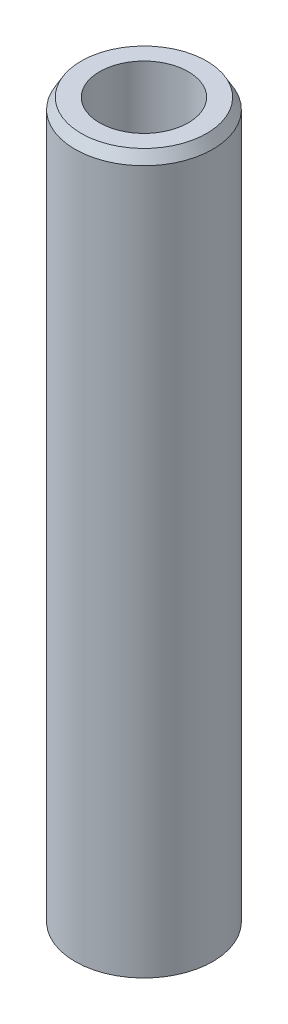
ISO-10303-21;
HEADER;
FILE_DESCRIPTION(('STEP AP214'),'2;1');
FILE_NAME('part.step','',(''),(''),'','','');
FILE_SCHEMA(('AUTOMOTIVE_DESIGN { 1 0 10303 214 1 1 1 1 }'));
ENDSEC;
DATA;
#1=APPLICATION_CONTEXT('core data for automotive mechanical design processes');
#2=APPLICATION_PROTOCOL_DEFINITION('international standard','automotive_design',2000,#1);
#3=PRODUCT_CONTEXT('',#1,'mechanical');
#4=PRODUCT('Part','Part','',(#3));
#5=PRODUCT_RELATED_PRODUCT_CATEGORY('part','',(#4));
#6=PRODUCT_DEFINITION_FORMATION('','',#4);
#7=PRODUCT_DEFINITION_CONTEXT('part definition',#1,'design');
#8=PRODUCT_DEFINITION('design','',#6,#7);
#9=PRODUCT_DEFINITION_SHAPE('','',#8);
#10=(LENGTH_UNIT() NAMED_UNIT(*) SI_UNIT(.MILLI.,.METRE.));
#11=(NAMED_UNIT(*) PLANE_ANGLE_UNIT() SI_UNIT($,.RADIAN.));
#12=(NAMED_UNIT(*) SI_UNIT($,.STERADIAN.) SOLID_ANGLE_UNIT());
#13=UNCERTAINTY_MEASURE_WITH_UNIT(LENGTH_MEASURE(1.E-05),#10,'distance_accuracy_value','');
#14=(GEOMETRIC_REPRESENTATION_CONTEXT(3) GLOBAL_UNCERTAINTY_ASSIGNED_CONTEXT((#13)) GLOBAL_UNIT_ASSIGNED_CONTEXT((#10,
#11,#12)) REPRESENTATION_CONTEXT('',''));
#15=CARTESIAN_POINT('',(0.,0.,0.));
#16=DIRECTION('',(0.,0.,1.));
#17=DIRECTION('',(1.,0.,0.));
#18=AXIS2_PLACEMENT_3D('',#15,#16,#17);
#19=CARTESIAN_POINT('',(0.,392.03608823877,0.));
#20=DIRECTION('',(0.,-1.,0.));
#21=DIRECTION('',(0.,0.,-1.));
#22=AXIS2_PLACEMENT_3D('',#19,#20,#21);
#23=CYLINDRICAL_SURFACE('',#22,37.5);
#24=CARTESIAN_POINT('',(0.,386.237186766016,0.));
#25=DIRECTION('',(0.,1.,0.));
#26=DIRECTION('',(0.,0.,1.));
#27=AXIS2_PLACEMENT_3D('',#24,#25,#26);
#28=CIRCLE('',#27,37.5);
#29=CARTESIAN_POINT('',(0.,386.237186766016,37.5));
#30=VERTEX_POINT('',#29);
#31=EDGE_CURVE('E50',#30,#30,#28,.F.);
#32=ORIENTED_EDGE('',*,*,#31,.T.);
#33=EDGE_LOOP('',(#32));
#34=FACE_BOUND('',#33,.T.);
#35=CARTESIAN_POINT('',(0.,3.3479973262987,0.));
#36=DIRECTION('',(0.,1.,0.));
#37=DIRECTION('',(0.,0.,1.));
#38=AXIS2_PLACEMENT_3D('',#35,#36,#37);
#39=CIRCLE('',#38,37.5);
#40=CARTESIAN_POINT('',(0.,3.3479973262987,37.5));
#41=VERTEX_POINT('',#40);
#42=EDGE_CURVE('E51',#41,#41,#39,.T.);
#43=ORIENTED_EDGE('',*,*,#42,.T.);
#44=EDGE_LOOP('',(#43));
#45=FACE_BOUND('',#44,.T.);
#46=ADVANCED_FACE('F39',(#34,#45),#23,.T.);
#47=CARTESIAN_POINT('',(0.,392.03608823877,0.));
#48=DIRECTION('',(0.,1.,0.));
#49=DIRECTION('',(0.,0.,1.));
#50=AXIS2_PLACEMENT_3D('',#47,#48,#49);
#51=PLANE('',#50);
#52=CARTESIAN_POINT('',(0.,392.03608823877,0.));
#53=DIRECTION('',(0.,1.,0.));
#54=DIRECTION('',(0.,0.,1.));
#55=AXIS2_PLACEMENT_3D('',#52,#53,#54);
#56=CIRCLE('',#55,34.1520026737012);
#57=CARTESIAN_POINT('',(0.,392.03608823877,34.1520026737012));
#58=VERTEX_POINT('',#57);
#59=EDGE_CURVE('E54',#58,#58,#56,.T.);
#60=ORIENTED_EDGE('',*,*,#59,.T.);
#61=EDGE_LOOP('',(#60));
#62=FACE_BOUND('',#61,.T.);
#63=CARTESIAN_POINT('',(0.,392.03608823877,0.));
#64=DIRECTION('',(0.,1.,0.));
#65=DIRECTION('',(0.,0.,1.));
#66=AXIS2_PLACEMENT_3D('',#63,#64,#65);
#67=CIRCLE('',#66,24.1432846169653);
#68=CARTESIAN_POINT('',(0.,392.03608823877,24.1432846169653));
#69=VERTEX_POINT('',#68);
#70=EDGE_CURVE('E58',#69,#69,#67,.T.);
#71=ORIENTED_EDGE('',*,*,#70,.F.);
#72=EDGE_LOOP('',(#71));
#73=FACE_BOUND('',#72,.T.);
#74=ADVANCED_FACE('F69',(#62,#73),#51,.T.);
#75=CARTESIAN_POINT('',(0.,0.,0.));
#76=DIRECTION('',(0.,1.,0.));
#77=DIRECTION('',(0.,0.,1.));
#78=AXIS2_PLACEMENT_3D('',#75,#76,#77);
#79=PLANE('',#78);
#80=CARTESIAN_POINT('',(0.,0.,0.));
#81=DIRECTION('',(0.,1.,0.));
#82=DIRECTION('',(0.,0.,1.));
#83=AXIS2_PLACEMENT_3D('',#80,#81,#82);
#84=CIRCLE('',#83,31.7010985272459);
#85=CARTESIAN_POINT('',(0.,0.,31.7010985272459));
#86=VERTEX_POINT('',#85);
#87=EDGE_CURVE('E10',#86,#86,#84,.F.);
#88=ORIENTED_EDGE('',*,*,#87,.T.);
#89=EDGE_LOOP('',(#88));
#90=FACE_BOUND('',#89,.T.);
#91=CARTESIAN_POINT('',(0.,0.,0.));
#92=DIRECTION('',(0.,1.,0.));
#93=DIRECTION('',(0.,0.,1.));
#94=AXIS2_PLACEMENT_3D('',#91,#92,#93);
#95=CIRCLE('',#94,24.1432846169653);
#96=CARTESIAN_POINT('',(0.,0.,24.1432846169653));
#97=VERTEX_POINT('',#96);
#98=EDGE_CURVE('E63',#97,#97,#95,.T.);
#99=ORIENTED_EDGE('',*,*,#98,.T.);
#100=EDGE_LOOP('',(#99));
#101=FACE_BOUND('',#100,.T.);
#102=ADVANCED_FACE('F75',(#90,#101),#79,.F.);
#103=CARTESIAN_POINT('',(0.,392.03608823877,0.));
#104=DIRECTION('',(0.,-1.,0.));
#105=DIRECTION('',(0.,0.,-1.));
#106=AXIS2_PLACEMENT_3D('',#103,#104,#105);
#107=CYLINDRICAL_SURFACE('',#106,24.1432846169653);
#108=ORIENTED_EDGE('',*,*,#70,.T.);
#109=EDGE_LOOP('',(#108));
#110=FACE_BOUND('',#109,.T.);
#111=ORIENTED_EDGE('',*,*,#98,.F.);
#112=EDGE_LOOP('',(#111));
#113=FACE_BOUND('',#112,.T.);
#114=ADVANCED_FACE('F70',(#110,#113),#107,.F.);
#115=CARTESIAN_POINT('',(0.,392.03608823877,0.));
#116=DIRECTION('',(0.,-1.,0.));
#117=DIRECTION('',(0.,0.,-1.));
#118=AXIS2_PLACEMENT_3D('',#115,#116,#117);
#119=CONICAL_SURFACE('',#118,34.1520026737012,0.523598775598296);
#120=ORIENTED_EDGE('',*,*,#31,.F.);
#121=EDGE_LOOP('',(#120));
#122=FACE_BOUND('',#121,.T.);
#123=ORIENTED_EDGE('',*,*,#59,.F.);
#124=EDGE_LOOP('',(#123));
#125=FACE_BOUND('',#124,.T.);
#126=ADVANCED_FACE('F81',(#122,#125),#119,.T.);
#127=CARTESIAN_POINT('',(0.,3.3479973262987,0.));
#128=DIRECTION('',(0.,1.,0.));
#129=DIRECTION('',(0.,0.,1.));
#130=AXIS2_PLACEMENT_3D('',#127,#128,#129);
#131=CONICAL_SURFACE('',#130,37.5,1.0471975511966);
#132=CARTESIAN_POINT('',(0.,0.,31.7010985272459));
#133=CARTESIAN_POINT('',(0.,0.0348749721489451,31.7615037509204));
#134=CARTESIAN_POINT('',(0.,0.0697499442978898,31.8219089745949));
#135=CARTESIAN_POINT('',(0.,0.139499888595779,31.942719421944));
#136=CARTESIAN_POINT('',(0.,0.174374860744724,32.0031246456185));
#137=CARTESIAN_POINT('',(0.,0.244124805042613,32.1239350929675));
#138=CARTESIAN_POINT('',(0.,0.278999777191557,32.1843403166421));
#139=CARTESIAN_POINT('',(0.,0.348749721489447,32.3051507639911));
#140=CARTESIAN_POINT('',(0.,0.383624693638393,32.3655559876656));
#141=CARTESIAN_POINT('',(0.,0.453374637936283,32.4863664350147));
#142=CARTESIAN_POINT('',(0.,0.488249610085227,32.5467716586892));
#143=CARTESIAN_POINT('',(0.,0.557999554383116,32.6675821060382));
#144=CARTESIAN_POINT('',(0.,0.592874526532061,32.7279873297128));
#145=CARTESIAN_POINT('',(0.,0.662624470829951,32.8487977770618));
#146=CARTESIAN_POINT('',(0.,0.697499442978896,32.9092030007363));
#147=CARTESIAN_POINT('',(0.,0.767249387276786,33.0300134480854));
#148=CARTESIAN_POINT('',(0.,0.80212435942573,33.0904186717599));
#149=CARTESIAN_POINT('',(0.,0.871874303723619,33.2112291191089));
#150=CARTESIAN_POINT('',(0.,0.906749275872565,33.2716343427835));
#151=CARTESIAN_POINT('',(0.,0.976499220170455,33.3924447901325));
#152=CARTESIAN_POINT('',(0.,1.0113741923194,33.452850013807));
#153=CARTESIAN_POINT('',(0.,1.08112413661729,33.5736604611561));
#154=CARTESIAN_POINT('',(0.,1.11599910876623,33.6340656848306));
#155=CARTESIAN_POINT('',(0.,1.18574905306412,33.7548761321796));
#156=CARTESIAN_POINT('',(0.,1.22062402521307,33.8152813558542));
#157=CARTESIAN_POINT('',(0.,1.29037396951096,33.9360918032032));
#158=CARTESIAN_POINT('',(0.,1.3252489416599,33.9964970268777));
#159=CARTESIAN_POINT('',(0.,1.39499888595779,34.1173074742268));
#160=CARTESIAN_POINT('',(0.,1.42987385810674,34.1777126979013));
#161=CARTESIAN_POINT('',(0.,1.49962380240463,34.2985231452503));
#162=CARTESIAN_POINT('',(0.,1.53449877455357,34.3589283689249));
#163=CARTESIAN_POINT('',(0.,1.60424871885146,34.4797388162739));
#164=CARTESIAN_POINT('',(0.,1.63912369100041,34.5401440399484));
#165=CARTESIAN_POINT('',(0.,1.70887363529829,34.6609544872975));
#166=CARTESIAN_POINT('',(0.,1.74374860744724,34.721359710972));
#167=CARTESIAN_POINT('',(0.,1.81349855174513,34.842170158321));
#168=CARTESIAN_POINT('',(0.,1.84837352389408,34.9025753819956));
#169=CARTESIAN_POINT('',(0.,1.91812346819196,35.0233858293446));
#170=CARTESIAN_POINT('',(0.,1.95299844034091,35.0837910530191));
#171=CARTESIAN_POINT('',(0.,2.0227483846388,35.2046015003682));
#172=CARTESIAN_POINT('',(0.,2.05762335678774,35.2650067240427));
#173=CARTESIAN_POINT('',(0.,2.12737330108563,35.3858171713917));
#174=CARTESIAN_POINT('',(0.,2.16224827323458,35.4462223950663));
#175=CARTESIAN_POINT('',(0.,2.23199821753247,35.5670328424153));
#176=CARTESIAN_POINT('',(0.,2.26687318968141,35.6274380660898));
#177=CARTESIAN_POINT('',(0.,2.3366231339793,35.7482485134389));
#178=CARTESIAN_POINT('',(0.,2.37149810612825,35.8086537371134));
#179=CARTESIAN_POINT('',(0.,2.44124805042614,35.9294641844624));
#180=CARTESIAN_POINT('',(0.,2.47612302257508,35.989869408137));
#181=CARTESIAN_POINT('',(0.,2.54587296687297,36.110679855486));
#182=CARTESIAN_POINT('',(0.,2.58074793902192,36.1710850791605));
#183=CARTESIAN_POINT('',(0.,2.6504978833198,36.2918955265096));
#184=CARTESIAN_POINT('',(0.,2.68537285546875,36.3523007501841));
#185=CARTESIAN_POINT('',(0.,2.75512279976664,36.4731111975331));
#186=CARTESIAN_POINT('',(0.,2.78999777191558,36.5335164212077));
#187=CARTESIAN_POINT('',(0.,2.85974771621347,36.6543268685567));
#188=CARTESIAN_POINT('',(0.,2.89462268836242,36.7147320922312));
#189=CARTESIAN_POINT('',(0.,2.96437263266031,36.8355425395803));
#190=CARTESIAN_POINT('',(0.,2.99924760480925,36.8959477632548));
#191=CARTESIAN_POINT('',(0.,3.06899754910714,37.0167582106038));
#192=CARTESIAN_POINT('',(0.,3.10387252125609,37.0771634342784));
#193=CARTESIAN_POINT('',(0.,3.17362246555398,37.1979738816274));
#194=CARTESIAN_POINT('',(0.,3.20849743770292,37.2583791053019));
#195=CARTESIAN_POINT('',(0.,3.27824738200081,37.379189552651));
#196=CARTESIAN_POINT('',(0.,3.31312235414976,37.4395947763255));
#197=CARTESIAN_POINT('',(0.,3.3479973262987,37.5));
#198=B_SPLINE_CURVE_WITH_KNOTS('',3,(#132,#133,#134,#135,#136,#137,#138,#139,#140,#141,#142,
#143,#144,#145,#146,#147,#148,#149,#150,#151,#152,#153,#154,#155,#156,#157,#158,#159,#160,#161,
#162,#163,#164,#165,#166,#167,#168,#169,#170,#171,#172,#173,#174,#175,#176,#177,#178,#179,#180,
#181,#182,#183,#184,#185,#186,#187,#188,#189,#190,#191,#192,#193,#194,#195,#196,#197),
.UNSPECIFIED.,.F.,.F.,(4,2,2,2,2,2,2,2,2,2,2,2,2,2,2,2,2,2,2,2,2,2,2,2,2,2,2,2,2,2,2,2,4),(0.,
0.209249832893665,0.418499665787336,0.627749498681007,0.836999331574673,1.04624916446834,
1.25549899736201,1.46474883025568,1.67399866314935,1.88324849604302,2.09249832893669,
2.30174816183036,2.51099799472402,2.72024782761769,2.92949766051137,3.13874749340503,
3.3479973262987,3.55724715919237,3.76649699208604,3.97574682497971,4.18499665787337,
4.39424649076705,4.60349632366072,4.81274615655438,5.02199598944805,5.23124582234172,
5.44049565523539,5.64974548812906,5.85899532102273,6.0682451539164,6.27749498681007,
6.48674481970374,6.69599465259741),.UNSPECIFIED.);
#199=EDGE_CURVE('BSEAM45',#86,#41,#198,.T.);
#200=ORIENTED_EDGE('',*,*,#87,.F.);
#201=ORIENTED_EDGE('',*,*,#42,.F.);
#202=ORIENTED_EDGE('',*,*,#199,.T.);
#203=ORIENTED_EDGE('',*,*,#199,.F.);
#204=EDGE_LOOP('',(#200,#202,#201,#203));
#205=FACE_BOUND('',#204,.T.);
#206=ADVANCED_FACE('F45',(#205),#131,.T.);
#207=CLOSED_SHELL('',(#46,#74,#102,#114,#126,#206));
#208=MANIFOLD_SOLID_BREP('B2',#207);
#209=ADVANCED_BREP_SHAPE_REPRESENTATION('',(#18,#208),#14);
#210=SHAPE_DEFINITION_REPRESENTATION(#9,#209);
ENDSEC;
END-ISO-10303-21;
